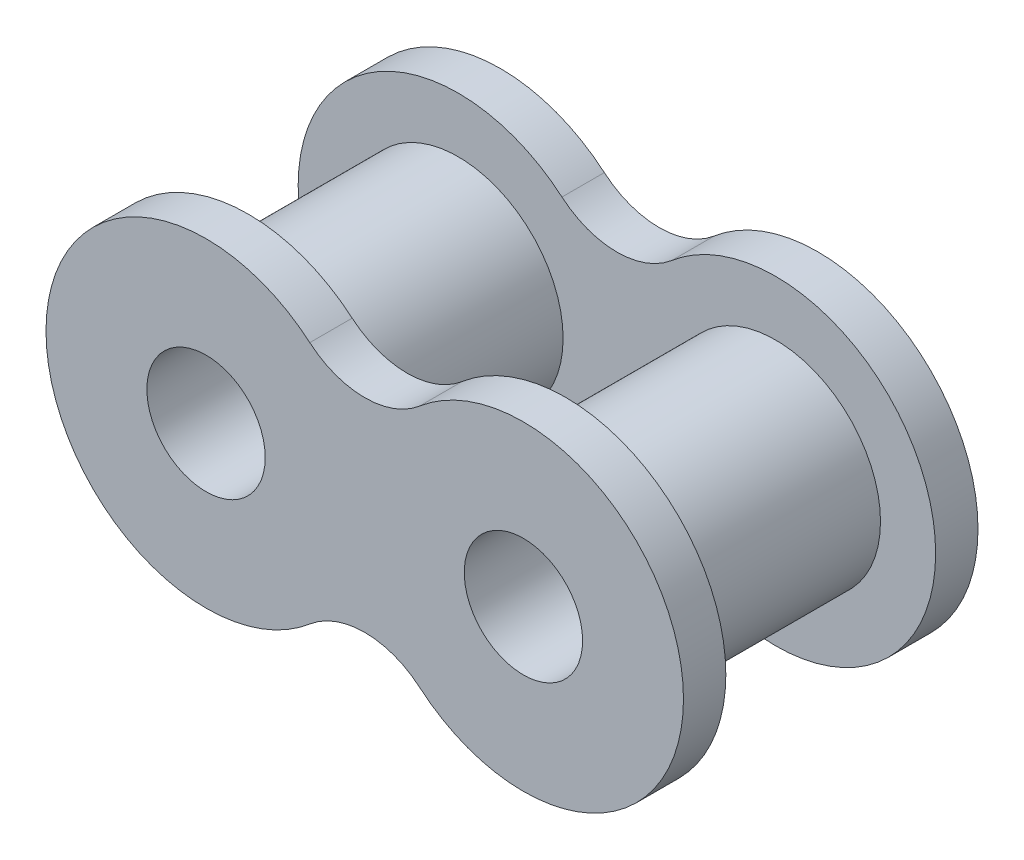
ISO-10303-21;
HEADER;
FILE_DESCRIPTION(('STEP AP214'),'2;1');
FILE_NAME('part.step','',(''),(''),'','','');
FILE_SCHEMA(('AUTOMOTIVE_DESIGN { 1 0 10303 214 1 1 1 1 }'));
ENDSEC;
DATA;
#1=APPLICATION_CONTEXT('core data for automotive mechanical design processes');
#2=APPLICATION_PROTOCOL_DEFINITION('international standard','automotive_design',2000,#1);
#3=PRODUCT_CONTEXT('',#1,'mechanical');
#4=PRODUCT('Part','Part','',(#3));
#5=PRODUCT_RELATED_PRODUCT_CATEGORY('part','',(#4));
#6=PRODUCT_DEFINITION_FORMATION('','',#4);
#7=PRODUCT_DEFINITION_CONTEXT('part definition',#1,'design');
#8=PRODUCT_DEFINITION('design','',#6,#7);
#9=PRODUCT_DEFINITION_SHAPE('','',#8);
#10=(LENGTH_UNIT() NAMED_UNIT(*) SI_UNIT(.MILLI.,.METRE.));
#11=(NAMED_UNIT(*) PLANE_ANGLE_UNIT() SI_UNIT($,.RADIAN.));
#12=(NAMED_UNIT(*) SI_UNIT($,.STERADIAN.) SOLID_ANGLE_UNIT());
#13=UNCERTAINTY_MEASURE_WITH_UNIT(LENGTH_MEASURE(1.E-05),#10,'distance_accuracy_value','');
#14=(GEOMETRIC_REPRESENTATION_CONTEXT(3) GLOBAL_UNCERTAINTY_ASSIGNED_CONTEXT((#13)) GLOBAL_UNIT_ASSIGNED_CONTEXT((#10,
#11,#12)) REPRESENTATION_CONTEXT('',''));
#15=CARTESIAN_POINT('',(0.,0.,0.));
#16=DIRECTION('',(0.,0.,1.));
#17=DIRECTION('',(1.,0.,0.));
#18=AXIS2_PLACEMENT_3D('',#15,#16,#17);
#19=CARTESIAN_POINT('',(-5.9944,0.,5.5626));
#20=DIRECTION('',(0.,0.,-1.));
#21=DIRECTION('',(-1.,0.,0.));
#22=AXIS2_PLACEMENT_3D('',#19,#20,#21);
#23=CYLINDRICAL_SURFACE('',#22,3.9624);
#24=CARTESIAN_POINT('',(-5.9944,0.,3.9624));
#25=DIRECTION('',(0.,0.,1.));
#26=DIRECTION('',(1.,0.,0.));
#27=AXIS2_PLACEMENT_3D('',#24,#25,#26);
#28=CIRCLE('',#27,3.9624);
#29=CARTESIAN_POINT('',(-2.032,0.,3.9624));
#30=VERTEX_POINT('',#29);
#31=EDGE_CURVE('E187',#30,#30,#28,.T.);
#32=ORIENTED_EDGE('',*,*,#31,.F.);
#33=EDGE_LOOP('',(#32));
#34=FACE_BOUND('',#33,.T.);
#35=CARTESIAN_POINT('',(-5.9944,0.,-3.9624));
#36=DIRECTION('',(0.,0.,-1.));
#37=DIRECTION('',(-1.,0.,0.));
#38=AXIS2_PLACEMENT_3D('',#35,#36,#37);
#39=CIRCLE('',#38,3.9624);
#40=CARTESIAN_POINT('',(-9.9568,0.,-3.9624));
#41=VERTEX_POINT('',#40);
#42=EDGE_CURVE('E11',#41,#41,#39,.T.);
#43=ORIENTED_EDGE('',*,*,#42,.F.);
#44=EDGE_LOOP('',(#43));
#45=FACE_BOUND('',#44,.T.);
#46=ADVANCED_FACE('F33',(#34,#45),#23,.T.);
#47=CARTESIAN_POINT('',(5.9944,0.,5.5626));
#48=DIRECTION('',(0.,0.,-1.));
#49=DIRECTION('',(-1.,0.,0.));
#50=AXIS2_PLACEMENT_3D('',#47,#48,#49);
#51=CYLINDRICAL_SURFACE('',#50,3.9624);
#52=CARTESIAN_POINT('',(5.9944,0.,3.9624));
#53=DIRECTION('',(0.,0.,1.));
#54=DIRECTION('',(1.,0.,0.));
#55=AXIS2_PLACEMENT_3D('',#52,#53,#54);
#56=CIRCLE('',#55,3.9624);
#57=CARTESIAN_POINT('',(9.9568,0.,3.9624));
#58=VERTEX_POINT('',#57);
#59=EDGE_CURVE('E154',#58,#58,#56,.F.);
#60=ORIENTED_EDGE('',*,*,#59,.T.);
#61=EDGE_LOOP('',(#60));
#62=FACE_BOUND('',#61,.T.);
#63=CARTESIAN_POINT('',(5.9944,0.,-3.9624));
#64=DIRECTION('',(0.,0.,-1.));
#65=DIRECTION('',(-1.,0.,0.));
#66=AXIS2_PLACEMENT_3D('',#63,#64,#65);
#67=CIRCLE('',#66,3.9624);
#68=CARTESIAN_POINT('',(2.032,0.,-3.9624));
#69=VERTEX_POINT('',#68);
#70=EDGE_CURVE('E41',#69,#69,#67,.T.);
#71=ORIENTED_EDGE('',*,*,#70,.F.);
#72=EDGE_LOOP('',(#71));
#73=FACE_BOUND('',#72,.T.);
#74=ADVANCED_FACE('F195',(#62,#73),#51,.T.);
#75=CARTESIAN_POINT('',(-5.9944,0.,5.5626));
#76=DIRECTION('',(0.,0.,1.));
#77=DIRECTION('',(1.,0.,0.));
#78=AXIS2_PLACEMENT_3D('',#75,#76,#77);
#79=PLANE('',#78);
#80=CARTESIAN_POINT('',(-5.9944,0.,5.5626));
#81=DIRECTION('',(0.,0.,1.));
#82=DIRECTION('',(1.,0.,0.));
#83=AXIS2_PLACEMENT_3D('',#80,#81,#82);
#84=CIRCLE('',#83,2.2352);
#85=CARTESIAN_POINT('',(-3.7592,0.,5.5626));
#86=VERTEX_POINT('',#85);
#87=EDGE_CURVE('E184',#86,#86,#84,.T.);
#88=ORIENTED_EDGE('',*,*,#87,.F.);
#89=EDGE_LOOP('',(#88));
#90=FACE_BOUND('',#89,.T.);
#91=CARTESIAN_POINT('',(0.,7.03905448195992,5.5626));
#92=DIRECTION('',(0.,0.,-1.));
#93=DIRECTION('',(1.,0.,0.));
#94=AXIS2_PLACEMENT_3D('',#91,#92,#93);
#95=CIRCLE('',#94,3.2004);
#96=CARTESIAN_POINT('',(2.07498461538461,4.60245869974302,5.5626));
#97=VERTEX_POINT('',#96);
#98=CARTESIAN_POINT('',(-2.07498461538462,4.60245869974302,5.5626));
#99=VERTEX_POINT('',#98);
#100=EDGE_CURVE('E159',#97,#99,#95,.T.);
#101=ORIENTED_EDGE('',*,*,#100,.T.);
#102=CARTESIAN_POINT('',(-5.9944,0.,5.5626));
#103=DIRECTION('',(0.,0.,1.));
#104=DIRECTION('',(1.,0.,0.));
#105=AXIS2_PLACEMENT_3D('',#102,#103,#104);
#106=CIRCLE('',#105,6.0452);
#107=CARTESIAN_POINT('',(-2.07498461538462,-4.60245869974302,5.5626));
#108=VERTEX_POINT('',#107);
#109=EDGE_CURVE('E171',#99,#108,#106,.T.);
#110=ORIENTED_EDGE('',*,*,#109,.T.);
#111=CARTESIAN_POINT('',(0.,-7.03905448195992,5.5626));
#112=DIRECTION('',(0.,0.,-1.));
#113=DIRECTION('',(-1.,0.,0.));
#114=AXIS2_PLACEMENT_3D('',#111,#112,#113);
#115=CIRCLE('',#114,3.2004);
#116=CARTESIAN_POINT('',(2.07498461538462,-4.60245869974302,5.5626));
#117=VERTEX_POINT('',#116);
#118=EDGE_CURVE('E174',#108,#117,#115,.T.);
#119=ORIENTED_EDGE('',*,*,#118,.T.);
#120=CARTESIAN_POINT('',(5.9944,0.,5.5626));
#121=DIRECTION('',(0.,0.,1.));
#122=DIRECTION('',(1.,0.,0.));
#123=AXIS2_PLACEMENT_3D('',#120,#121,#122);
#124=CIRCLE('',#123,6.0452);
#125=EDGE_CURVE('E163',#117,#97,#124,.T.);
#126=ORIENTED_EDGE('',*,*,#125,.T.);
#127=EDGE_LOOP('',(#101,#110,#119,#126));
#128=FACE_BOUND('',#127,.T.);
#129=CARTESIAN_POINT('',(5.9944,0.,5.5626));
#130=DIRECTION('',(0.,0.,1.));
#131=DIRECTION('',(1.,0.,0.));
#132=AXIS2_PLACEMENT_3D('',#129,#130,#131);
#133=CIRCLE('',#132,2.2352);
#134=CARTESIAN_POINT('',(8.2296,0.,5.5626));
#135=VERTEX_POINT('',#134);
#136=EDGE_CURVE('E151',#135,#135,#133,.T.);
#137=ORIENTED_EDGE('',*,*,#136,.F.);
#138=EDGE_LOOP('',(#137));
#139=FACE_BOUND('',#138,.T.);
#140=ADVANCED_FACE('F197',(#90,#128,#139),#79,.T.);
#141=CARTESIAN_POINT('',(-5.9944,0.,-5.5626));
#142=DIRECTION('',(0.,0.,1.));
#143=DIRECTION('',(1.,0.,0.));
#144=AXIS2_PLACEMENT_3D('',#141,#142,#143);
#145=PLANE('',#144);
#146=CARTESIAN_POINT('',(-5.9944,0.,-5.5626));
#147=DIRECTION('',(0.,0.,1.));
#148=DIRECTION('',(1.,0.,0.));
#149=AXIS2_PLACEMENT_3D('',#146,#147,#148);
#150=CIRCLE('',#149,2.2352);
#151=CARTESIAN_POINT('',(-3.7592,0.,-5.5626));
#152=VERTEX_POINT('',#151);
#153=EDGE_CURVE('E179',#152,#152,#150,.T.);
#154=ORIENTED_EDGE('',*,*,#153,.T.);
#155=EDGE_LOOP('',(#154));
#156=FACE_BOUND('',#155,.T.);
#157=CARTESIAN_POINT('',(5.9944,0.,-5.5626));
#158=DIRECTION('',(0.,0.,1.));
#159=DIRECTION('',(1.,0.,0.));
#160=AXIS2_PLACEMENT_3D('',#157,#158,#159);
#161=CIRCLE('',#160,2.2352);
#162=CARTESIAN_POINT('',(8.2296,0.,-5.5626));
#163=VERTEX_POINT('',#162);
#164=EDGE_CURVE('E146',#163,#163,#161,.T.);
#165=ORIENTED_EDGE('',*,*,#164,.T.);
#166=EDGE_LOOP('',(#165));
#167=FACE_BOUND('',#166,.T.);
#168=CARTESIAN_POINT('',(0.,7.03905448195992,-5.5626));
#169=DIRECTION('',(0.,0.,-1.));
#170=DIRECTION('',(1.,0.,0.));
#171=AXIS2_PLACEMENT_3D('',#168,#169,#170);
#172=CIRCLE('',#171,3.2004);
#173=CARTESIAN_POINT('',(2.07498461538461,4.60245869974302,-5.5626));
#174=VERTEX_POINT('',#173);
#175=CARTESIAN_POINT('',(-2.07498461538462,4.60245869974302,-5.5626));
#176=VERTEX_POINT('',#175);
#177=EDGE_CURVE('E141',#174,#176,#172,.T.);
#178=ORIENTED_EDGE('',*,*,#177,.F.);
#179=CARTESIAN_POINT('',(5.9944,0.,-5.5626));
#180=DIRECTION('',(0.,0.,1.));
#181=DIRECTION('',(1.,0.,0.));
#182=AXIS2_PLACEMENT_3D('',#179,#180,#181);
#183=CIRCLE('',#182,6.0452);
#184=CARTESIAN_POINT('',(2.07498461538462,-4.60245869974302,-5.5626));
#185=VERTEX_POINT('',#184);
#186=EDGE_CURVE('E124',#185,#174,#183,.T.);
#187=ORIENTED_EDGE('',*,*,#186,.F.);
#188=CARTESIAN_POINT('',(0.,-7.03905448195992,-5.5626));
#189=DIRECTION('',(0.,0.,-1.));
#190=DIRECTION('',(-1.,0.,0.));
#191=AXIS2_PLACEMENT_3D('',#188,#189,#190);
#192=CIRCLE('',#191,3.2004);
#193=CARTESIAN_POINT('',(-2.07498461538462,-4.60245869974302,-5.5626));
#194=VERTEX_POINT('',#193);
#195=EDGE_CURVE('E136',#194,#185,#192,.T.);
#196=ORIENTED_EDGE('',*,*,#195,.F.);
#197=CARTESIAN_POINT('',(-5.9944,0.,-5.5626));
#198=DIRECTION('',(0.,0.,1.));
#199=DIRECTION('',(1.,0.,0.));
#200=AXIS2_PLACEMENT_3D('',#197,#198,#199);
#201=CIRCLE('',#200,6.0452);
#202=EDGE_CURVE('E134',#176,#194,#201,.T.);
#203=ORIENTED_EDGE('',*,*,#202,.F.);
#204=EDGE_LOOP('',(#178,#187,#196,#203));
#205=FACE_BOUND('',#204,.T.);
#206=ADVANCED_FACE('F204',(#156,#167,#205),#145,.F.);
#207=CARTESIAN_POINT('',(-5.9944,0.,5.5626));
#208=DIRECTION('',(0.,0.,-1.));
#209=DIRECTION('',(-1.,0.,0.));
#210=AXIS2_PLACEMENT_3D('',#207,#208,#209);
#211=CYLINDRICAL_SURFACE('',#210,2.2352);
#212=ORIENTED_EDGE('',*,*,#87,.T.);
#213=EDGE_LOOP('',(#212));
#214=FACE_BOUND('',#213,.T.);
#215=ORIENTED_EDGE('',*,*,#153,.F.);
#216=EDGE_LOOP('',(#215));
#217=FACE_BOUND('',#216,.T.);
#218=ADVANCED_FACE('F228',(#214,#217),#211,.F.);
#219=CARTESIAN_POINT('',(0.,7.03905448195992,3.9624));
#220=DIRECTION('',(0.,0.,1.));
#221=DIRECTION('',(1.,0.,0.));
#222=AXIS2_PLACEMENT_3D('',#219,#220,#221);
#223=CYLINDRICAL_SURFACE('',#222,3.2004);
#224=ORIENTED_EDGE('',*,*,#100,.F.);
#225=DIRECTION('',(0.,0.,1.));
#226=VECTOR('',#225,1.);
#227=CARTESIAN_POINT('',(2.07498461538461,4.60245869974302,3.9624));
#228=LINE('',#227,#226);
#229=CARTESIAN_POINT('',(2.07498461538461,4.60245869974302,3.9624));
#230=VERTEX_POINT('',#229);
#231=EDGE_CURVE('E49',#230,#97,#228,.T.);
#232=ORIENTED_EDGE('',*,*,#231,.F.);
#233=CARTESIAN_POINT('',(0.,7.03905448195992,3.9624));
#234=DIRECTION('',(0.,0.,-1.));
#235=DIRECTION('',(1.,0.,0.));
#236=AXIS2_PLACEMENT_3D('',#233,#234,#235);
#237=CIRCLE('',#236,3.2004);
#238=CARTESIAN_POINT('',(-2.07498461538462,4.60245869974302,3.9624));
#239=VERTEX_POINT('',#238);
#240=EDGE_CURVE('E160',#230,#239,#237,.T.);
#241=ORIENTED_EDGE('',*,*,#240,.T.);
#242=DIRECTION('',(0.,0.,1.));
#243=VECTOR('',#242,1.);
#244=CARTESIAN_POINT('',(-2.07498461538462,4.60245869974302,3.9624));
#245=LINE('',#244,#243);
#246=EDGE_CURVE('E78',#239,#99,#245,.T.);
#247=ORIENTED_EDGE('',*,*,#246,.T.);
#248=EDGE_LOOP('',(#224,#232,#241,#247));
#249=FACE_BOUND('',#248,.T.);
#250=ADVANCED_FACE('F221',(#249),#223,.F.);
#251=CARTESIAN_POINT('',(5.9944,0.,3.9624));
#252=DIRECTION('',(0.,0.,1.));
#253=DIRECTION('',(1.,0.,0.));
#254=AXIS2_PLACEMENT_3D('',#251,#252,#253);
#255=CYLINDRICAL_SURFACE('',#254,6.0452);
#256=ORIENTED_EDGE('',*,*,#125,.F.);
#257=DIRECTION('',(0.,0.,1.));
#258=VECTOR('',#257,1.);
#259=CARTESIAN_POINT('',(2.07498461538462,-4.60245869974302,3.9624));
#260=LINE('',#259,#258);
#261=CARTESIAN_POINT('',(2.07498461538462,-4.60245869974302,3.9624));
#262=VERTEX_POINT('',#261);
#263=EDGE_CURVE('E67',#262,#117,#260,.T.);
#264=ORIENTED_EDGE('',*,*,#263,.F.);
#265=CARTESIAN_POINT('',(5.9944,0.,3.9624));
#266=DIRECTION('',(0.,0.,1.));
#267=DIRECTION('',(1.,0.,0.));
#268=AXIS2_PLACEMENT_3D('',#265,#266,#267);
#269=CIRCLE('',#268,6.0452);
#270=EDGE_CURVE('E167',#262,#230,#269,.T.);
#271=ORIENTED_EDGE('',*,*,#270,.T.);
#272=ORIENTED_EDGE('',*,*,#231,.T.);
#273=EDGE_LOOP('',(#256,#264,#271,#272));
#274=FACE_BOUND('',#273,.T.);
#275=ADVANCED_FACE('F217',(#274),#255,.T.);
#276=CARTESIAN_POINT('',(0.,-7.03905448195992,3.9624));
#277=DIRECTION('',(0.,0.,1.));
#278=DIRECTION('',(1.,0.,0.));
#279=AXIS2_PLACEMENT_3D('',#276,#277,#278);
#280=CYLINDRICAL_SURFACE('',#279,3.2004);
#281=ORIENTED_EDGE('',*,*,#118,.F.);
#282=DIRECTION('',(0.,0.,1.));
#283=VECTOR('',#282,1.);
#284=CARTESIAN_POINT('',(-2.07498461538462,-4.60245869974302,3.9624));
#285=LINE('',#284,#283);
#286=CARTESIAN_POINT('',(-2.07498461538462,-4.60245869974302,3.9624));
#287=VERTEX_POINT('',#286);
#288=EDGE_CURVE('E181',#287,#108,#285,.T.);
#289=ORIENTED_EDGE('',*,*,#288,.F.);
#290=CARTESIAN_POINT('',(0.,-7.03905448195992,3.9624));
#291=DIRECTION('',(0.,0.,-1.));
#292=DIRECTION('',(-1.,0.,0.));
#293=AXIS2_PLACEMENT_3D('',#290,#291,#292);
#294=CIRCLE('',#293,3.2004);
#295=EDGE_CURVE('E165',#287,#262,#294,.T.);
#296=ORIENTED_EDGE('',*,*,#295,.T.);
#297=ORIENTED_EDGE('',*,*,#263,.T.);
#298=EDGE_LOOP('',(#281,#289,#296,#297));
#299=FACE_BOUND('',#298,.T.);
#300=ADVANCED_FACE('F220',(#299),#280,.F.);
#301=CARTESIAN_POINT('',(-5.9944,0.,3.9624));
#302=DIRECTION('',(0.,0.,1.));
#303=DIRECTION('',(1.,0.,0.));
#304=AXIS2_PLACEMENT_3D('',#301,#302,#303);
#305=CYLINDRICAL_SURFACE('',#304,6.0452);
#306=ORIENTED_EDGE('',*,*,#109,.F.);
#307=ORIENTED_EDGE('',*,*,#246,.F.);
#308=CARTESIAN_POINT('',(-5.9944,0.,3.9624));
#309=DIRECTION('',(0.,0.,1.));
#310=DIRECTION('',(1.,0.,0.));
#311=AXIS2_PLACEMENT_3D('',#308,#309,#310);
#312=CIRCLE('',#311,6.0452);
#313=EDGE_CURVE('E162',#239,#287,#312,.T.);
#314=ORIENTED_EDGE('',*,*,#313,.T.);
#315=ORIENTED_EDGE('',*,*,#288,.T.);
#316=EDGE_LOOP('',(#306,#307,#314,#315));
#317=FACE_BOUND('',#316,.T.);
#318=ADVANCED_FACE('F215',(#317),#305,.T.);
#319=CARTESIAN_POINT('',(2.9972,3.51952724097996,3.9624));
#320=DIRECTION('',(0.,0.,1.));
#321=DIRECTION('',(1.,0.,0.));
#322=AXIS2_PLACEMENT_3D('',#319,#320,#321);
#323=PLANE('',#322);
#324=ORIENTED_EDGE('',*,*,#31,.T.);
#325=EDGE_LOOP('',(#324));
#326=FACE_BOUND('',#325,.T.);
#327=ORIENTED_EDGE('',*,*,#59,.F.);
#328=EDGE_LOOP('',(#327));
#329=FACE_BOUND('',#328,.T.);
#330=ORIENTED_EDGE('',*,*,#240,.F.);
#331=ORIENTED_EDGE('',*,*,#270,.F.);
#332=ORIENTED_EDGE('',*,*,#295,.F.);
#333=ORIENTED_EDGE('',*,*,#313,.F.);
#334=EDGE_LOOP('',(#330,#331,#332,#333));
#335=FACE_BOUND('',#334,.T.);
#336=ADVANCED_FACE('F212',(#326,#329,#335),#323,.F.);
#337=CARTESIAN_POINT('',(5.9944,0.,5.5626));
#338=DIRECTION('',(0.,0.,-1.));
#339=DIRECTION('',(-1.,0.,0.));
#340=AXIS2_PLACEMENT_3D('',#337,#338,#339);
#341=CYLINDRICAL_SURFACE('',#340,2.2352);
#342=ORIENTED_EDGE('',*,*,#136,.T.);
#343=EDGE_LOOP('',(#342));
#344=FACE_BOUND('',#343,.T.);
#345=ORIENTED_EDGE('',*,*,#164,.F.);
#346=EDGE_LOOP('',(#345));
#347=FACE_BOUND('',#346,.T.);
#348=ADVANCED_FACE('F210',(#344,#347),#341,.F.);
#349=CARTESIAN_POINT('',(2.9972,3.51952724097996,-3.9624));
#350=DIRECTION('',(0.,0.,-1.));
#351=DIRECTION('',(1.,0.,0.));
#352=AXIS2_PLACEMENT_3D('',#349,#350,#351);
#353=PLANE('',#352);
#354=CARTESIAN_POINT('',(0.,7.03905448195992,-3.9624));
#355=DIRECTION('',(0.,0.,-1.));
#356=DIRECTION('',(1.,0.,0.));
#357=AXIS2_PLACEMENT_3D('',#354,#355,#356);
#358=CIRCLE('',#357,3.2004);
#359=CARTESIAN_POINT('',(2.07498461538461,4.60245869974302,-3.9624));
#360=VERTEX_POINT('',#359);
#361=CARTESIAN_POINT('',(-2.07498461538462,4.60245869974302,-3.9624));
#362=VERTEX_POINT('',#361);
#363=EDGE_CURVE('E112',#360,#362,#358,.T.);
#364=ORIENTED_EDGE('',*,*,#363,.T.);
#365=CARTESIAN_POINT('',(-5.9944,0.,-3.9624));
#366=DIRECTION('',(0.,0.,1.));
#367=DIRECTION('',(1.,0.,0.));
#368=AXIS2_PLACEMENT_3D('',#365,#366,#367);
#369=CIRCLE('',#368,6.0452);
#370=CARTESIAN_POINT('',(-2.07498461538462,-4.60245869974302,-3.9624));
#371=VERTEX_POINT('',#370);
#372=EDGE_CURVE('E129',#362,#371,#369,.T.);
#373=ORIENTED_EDGE('',*,*,#372,.T.);
#374=CARTESIAN_POINT('',(0.,-7.03905448195992,-3.9624));
#375=DIRECTION('',(0.,0.,-1.));
#376=DIRECTION('',(-1.,0.,0.));
#377=AXIS2_PLACEMENT_3D('',#374,#375,#376);
#378=CIRCLE('',#377,3.2004);
#379=CARTESIAN_POINT('',(2.07498461538462,-4.60245869974302,-3.9624));
#380=VERTEX_POINT('',#379);
#381=EDGE_CURVE('E115',#371,#380,#378,.T.);
#382=ORIENTED_EDGE('',*,*,#381,.T.);
#383=CARTESIAN_POINT('',(5.9944,0.,-3.9624));
#384=DIRECTION('',(0.,0.,1.));
#385=DIRECTION('',(1.,0.,0.));
#386=AXIS2_PLACEMENT_3D('',#383,#384,#385);
#387=CIRCLE('',#386,6.0452);
#388=EDGE_CURVE('E107',#380,#360,#387,.T.);
#389=ORIENTED_EDGE('',*,*,#388,.T.);
#390=EDGE_LOOP('',(#364,#373,#382,#389));
#391=FACE_BOUND('',#390,.T.);
#392=ORIENTED_EDGE('',*,*,#70,.T.);
#393=EDGE_LOOP('',(#392));
#394=FACE_BOUND('',#393,.T.);
#395=ORIENTED_EDGE('',*,*,#42,.T.);
#396=EDGE_LOOP('',(#395));
#397=FACE_BOUND('',#396,.T.);
#398=ADVANCED_FACE('F109',(#391,#394,#397),#353,.F.);
#399=CARTESIAN_POINT('',(0.,7.03905448195992,-3.9624));
#400=DIRECTION('',(0.,0.,-1.));
#401=DIRECTION('',(-1.,0.,0.));
#402=AXIS2_PLACEMENT_3D('',#399,#400,#401);
#403=CYLINDRICAL_SURFACE('',#402,3.2004);
#404=ORIENTED_EDGE('',*,*,#177,.T.);
#405=DIRECTION('',(0.,0.,-1.));
#406=VECTOR('',#405,1.);
#407=CARTESIAN_POINT('',(-2.07498461538462,4.60245869974302,-3.9624));
#408=LINE('',#407,#406);
#409=EDGE_CURVE('E133',#362,#176,#408,.T.);
#410=ORIENTED_EDGE('',*,*,#409,.F.);
#411=ORIENTED_EDGE('',*,*,#363,.F.);
#412=DIRECTION('',(0.,0.,-1.));
#413=VECTOR('',#412,1.);
#414=CARTESIAN_POINT('',(2.07498461538461,4.60245869974302,-3.9624));
#415=LINE('',#414,#413);
#416=EDGE_CURVE('E121',#360,#174,#415,.T.);
#417=ORIENTED_EDGE('',*,*,#416,.T.);
#418=EDGE_LOOP('',(#404,#410,#411,#417));
#419=FACE_BOUND('',#418,.T.);
#420=ADVANCED_FACE('F131',(#419),#403,.F.);
#421=CARTESIAN_POINT('',(-5.9944,0.,-3.9624));
#422=DIRECTION('',(0.,0.,-1.));
#423=DIRECTION('',(-1.,0.,0.));
#424=AXIS2_PLACEMENT_3D('',#421,#422,#423);
#425=CYLINDRICAL_SURFACE('',#424,6.0452);
#426=ORIENTED_EDGE('',*,*,#202,.T.);
#427=DIRECTION('',(0.,0.,-1.));
#428=VECTOR('',#427,1.);
#429=CARTESIAN_POINT('',(-2.07498461538462,-4.60245869974302,-3.9624));
#430=LINE('',#429,#428);
#431=EDGE_CURVE('E147',#371,#194,#430,.T.);
#432=ORIENTED_EDGE('',*,*,#431,.F.);
#433=ORIENTED_EDGE('',*,*,#372,.F.);
#434=ORIENTED_EDGE('',*,*,#409,.T.);
#435=EDGE_LOOP('',(#426,#432,#433,#434));
#436=FACE_BOUND('',#435,.T.);
#437=ADVANCED_FACE('F242',(#436),#425,.T.);
#438=CARTESIAN_POINT('',(0.,-7.03905448195992,-3.9624));
#439=DIRECTION('',(0.,0.,-1.));
#440=DIRECTION('',(-1.,0.,0.));
#441=AXIS2_PLACEMENT_3D('',#438,#439,#440);
#442=CYLINDRICAL_SURFACE('',#441,3.2004);
#443=ORIENTED_EDGE('',*,*,#195,.T.);
#444=DIRECTION('',(0.,0.,-1.));
#445=VECTOR('',#444,1.);
#446=CARTESIAN_POINT('',(2.07498461538462,-4.60245869974302,-3.9624));
#447=LINE('',#446,#445);
#448=EDGE_CURVE('E128',#380,#185,#447,.T.);
#449=ORIENTED_EDGE('',*,*,#448,.F.);
#450=ORIENTED_EDGE('',*,*,#381,.F.);
#451=ORIENTED_EDGE('',*,*,#431,.T.);
#452=EDGE_LOOP('',(#443,#449,#450,#451));
#453=FACE_BOUND('',#452,.T.);
#454=ADVANCED_FACE('F244',(#453),#442,.F.);
#455=CARTESIAN_POINT('',(5.9944,0.,-3.9624));
#456=DIRECTION('',(0.,0.,-1.));
#457=DIRECTION('',(-1.,0.,0.));
#458=AXIS2_PLACEMENT_3D('',#455,#456,#457);
#459=CYLINDRICAL_SURFACE('',#458,6.0452);
#460=ORIENTED_EDGE('',*,*,#186,.T.);
#461=ORIENTED_EDGE('',*,*,#416,.F.);
#462=ORIENTED_EDGE('',*,*,#388,.F.);
#463=ORIENTED_EDGE('',*,*,#448,.T.);
#464=EDGE_LOOP('',(#460,#461,#462,#463));
#465=FACE_BOUND('',#464,.T.);
#466=ADVANCED_FACE('F122',(#465),#459,.T.);
#467=CLOSED_SHELL('',(#46,#74,#140,#206,#218,#250,#275,#300,#318,#336,#348,#398,#420,#437,#454,#466));
#468=MANIFOLD_SOLID_BREP('B2',#467);
#469=ADVANCED_BREP_SHAPE_REPRESENTATION('',(#18,#468),#14);
#470=SHAPE_DEFINITION_REPRESENTATION(#9,#469);
ENDSEC;
END-ISO-10303-21;
